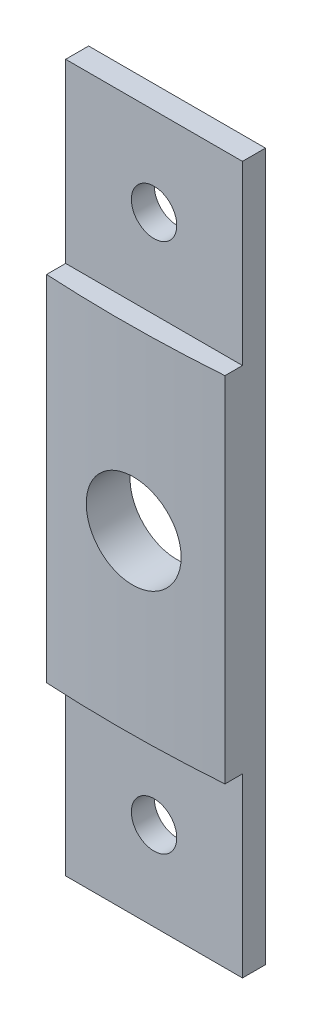
ISO-10303-21;
HEADER;
FILE_DESCRIPTION(('STEP AP214'),'2;1');
FILE_NAME('part.step','',(''),(''),'','','');
FILE_SCHEMA(('AUTOMOTIVE_DESIGN { 1 0 10303 214 1 1 1 1 }'));
ENDSEC;
DATA;
#1=APPLICATION_CONTEXT('core data for automotive mechanical design processes');
#2=APPLICATION_PROTOCOL_DEFINITION('international standard','automotive_design',2000,#1);
#3=PRODUCT_CONTEXT('',#1,'mechanical');
#4=PRODUCT('Part','Part','',(#3));
#5=PRODUCT_RELATED_PRODUCT_CATEGORY('part','',(#4));
#6=PRODUCT_DEFINITION_FORMATION('','',#4);
#7=PRODUCT_DEFINITION_CONTEXT('part definition',#1,'design');
#8=PRODUCT_DEFINITION('design','',#6,#7);
#9=PRODUCT_DEFINITION_SHAPE('','',#8);
#10=(LENGTH_UNIT() NAMED_UNIT(*) SI_UNIT(.MILLI.,.METRE.));
#11=(NAMED_UNIT(*) PLANE_ANGLE_UNIT() SI_UNIT($,.RADIAN.));
#12=(NAMED_UNIT(*) SI_UNIT($,.STERADIAN.) SOLID_ANGLE_UNIT());
#13=UNCERTAINTY_MEASURE_WITH_UNIT(LENGTH_MEASURE(1.E-05),#10,'distance_accuracy_value','');
#14=(GEOMETRIC_REPRESENTATION_CONTEXT(3) GLOBAL_UNCERTAINTY_ASSIGNED_CONTEXT((#13)) GLOBAL_UNIT_ASSIGNED_CONTEXT((#10,
#11,#12)) REPRESENTATION_CONTEXT('',''));
#15=CARTESIAN_POINT('',(0.,0.,0.));
#16=DIRECTION('',(0.,0.,1.));
#17=DIRECTION('',(1.,0.,0.));
#18=AXIS2_PLACEMENT_3D('',#15,#16,#17);
#19=CARTESIAN_POINT('',(0.,-278.797022402708,-95.25));
#20=DIRECTION('',(0.,1.,0.));
#21=DIRECTION('',(0.,0.,1.));
#22=AXIS2_PLACEMENT_3D('',#19,#20,#21);
#23=CYLINDRICAL_SURFACE('',#22,98.425);
#24=CARTESIAN_POINT('',(0.,2.37479674796748,-95.25));
#25=DIRECTION('',(0.,1.,0.));
#26=DIRECTION('',(0.,0.,1.));
#27=AXIS2_PLACEMENT_3D('',#24,#25,#26);
#28=CIRCLE('',#27,98.425);
#29=CARTESIAN_POINT('',(7.22764227642276,2.37479674796748,2.90926758143659));
#30=VERTEX_POINT('',#29);
#31=CARTESIAN_POINT('',(-5.47235772357724,2.37479674796748,3.02275271378738));
#32=VERTEX_POINT('',#31);
#33=EDGE_CURVE('E112',#30,#32,#28,.F.);
#34=ORIENTED_EDGE('',*,*,#33,.F.);
#35=DIRECTION('',(0.,1.,0.));
#36=VECTOR('',#35,1.);
#37=CARTESIAN_POINT('',(7.22764227642279,-278.797022402708,2.90926758143659));
#38=LINE('',#37,#36);
#39=CARTESIAN_POINT('',(7.22764227642276,27.7747967479675,2.9092675814366));
#40=VERTEX_POINT('',#39);
#41=EDGE_CURVE('E117',#40,#30,#38,.F.);
#42=ORIENTED_EDGE('',*,*,#41,.F.);
#43=CARTESIAN_POINT('',(0.,27.7747967479675,-95.25));
#44=DIRECTION('',(0.,-1.,0.));
#45=DIRECTION('',(0.,0.,-1.));
#46=AXIS2_PLACEMENT_3D('',#43,#44,#45);
#47=CIRCLE('',#46,98.425);
#48=CARTESIAN_POINT('',(-5.47235772357724,27.7747967479675,3.02275271378739));
#49=VERTEX_POINT('',#48);
#50=EDGE_CURVE('E47',#40,#49,#47,.T.);
#51=ORIENTED_EDGE('',*,*,#50,.T.);
#52=DIRECTION('',(0.,1.,0.));
#53=VECTOR('',#52,1.);
#54=CARTESIAN_POINT('',(-5.4723577235772,-278.797022402708,3.02275271378739));
#55=LINE('',#54,#53);
#56=EDGE_CURVE('E108',#49,#32,#55,.F.);
#57=ORIENTED_EDGE('',*,*,#56,.T.);
#58=EDGE_LOOP('',(#34,#42,#51,#57));
#59=FACE_BOUND('',#58,.T.);
#60=CARTESIAN_POINT('',(0.,18.337001412705,3.17500000000001));
#61=CARTESIAN_POINT('',(0.183163774329728,18.3862699131995,3.17499923295771));
#62=CARTESIAN_POINT('',(0.370618506350538,18.420112357294,3.1744833048946));
#63=CARTESIAN_POINT('',(0.748696883253728,18.4558831728512,3.17233438141036));
#64=CARTESIAN_POINT('',(0.939324030989922,18.4577735503428,3.17070005851524));
#65=CARTESIAN_POINT('',(1.31810349634827,18.4295342032097,3.16635570330243));
#66=CARTESIAN_POINT('',(1.50625697091006,18.3994200286868,3.16364619378798));
#67=CARTESIAN_POINT('',(1.87477767555351,18.3080601384446,3.15731586236169));
#68=CARTESIAN_POINT('',(2.05514678005276,18.246821963039,3.15369526128434));
#69=CARTESIAN_POINT('',(2.40311827028649,18.0949308812085,3.14581279900255));
#70=CARTESIAN_POINT('',(2.57071528735451,18.0042656886182,3.14155067035122));
#71=CARTESIAN_POINT('',(2.8883186641795,17.7960960163174,3.13273994796942));
#72=CARTESIAN_POINT('',(3.03832427364177,17.6785903924598,3.12819134203307));
#73=CARTESIAN_POINT('',(3.31657209541615,17.4199941230677,3.11920455482662));
#74=CARTESIAN_POINT('',(3.4448015474168,17.2788897446755,3.11476643959231));
#75=CARTESIAN_POINT('',(3.6757511501773,16.9771424388507,3.10640738089549));
#76=CARTESIAN_POINT('',(3.77847135945796,16.8164995562426,3.10248643624655));
#77=CARTESIAN_POINT('',(3.95547236390289,16.4802474922343,3.09552731700965));
#78=CARTESIAN_POINT('',(4.02975622278909,16.3046399256174,3.09248904733113));
#79=CARTESIAN_POINT('',(4.14778175991391,15.9434296465907,3.08758206459831));
#80=CARTESIAN_POINT('',(4.19152365595121,15.7578270054671,3.08571334320381));
#81=CARTESIAN_POINT('',(4.24719352568425,15.3820539635518,3.0833247698372));
#82=CARTESIAN_POINT('',(4.2591469367588,15.1918873379351,3.08280383936196));
#83=CARTESIAN_POINT('',(4.25097162182068,14.8122464901152,3.08315758298348));
#84=CARTESIAN_POINT('',(4.23084296557456,14.6227722664072,3.08403225404533));
#85=CARTESIAN_POINT('',(4.15909521199345,14.2499844164746,3.08709281873213));
#86=CARTESIAN_POINT('',(4.10749047589063,14.066668020909,3.08927811436575));
#87=CARTESIAN_POINT('',(3.97427343139461,13.711301571906,3.09475172078679));
#88=CARTESIAN_POINT('',(3.89266104142145,13.5392515490991,3.09804003457291));
#89=CARTESIAN_POINT('',(3.7016994688612,13.2112048603761,3.10541237133611));
#90=CARTESIAN_POINT('',(3.59233628440084,13.0552163544397,3.10949679575489));
#91=CARTESIAN_POINT('',(3.34899567947401,12.7638052149987,3.11808238570689));
#92=CARTESIAN_POINT('',(3.21501813116291,12.6283826883185,3.12258355340458));
#93=CARTESIAN_POINT('',(2.92612863370945,12.3818379238092,3.13160017938744));
#94=CARTESIAN_POINT('',(2.77120036625512,12.2707348065599,3.1361156461056));
#95=CARTESIAN_POINT('',(2.44488040810793,12.0761153318647,3.14476503433411));
#96=CARTESIAN_POINT('',(2.27348871175923,11.9925989838959,3.1488989557134));
#97=CARTESIAN_POINT('',(1.9190910085905,11.8555237927114,3.15644846982117));
#98=CARTESIAN_POINT('',(1.7360843655135,11.8019665922123,3.15986402315378));
#99=CARTESIAN_POINT('',(1.3636610963515,11.7263456210613,3.16572902326381));
#100=CARTESIAN_POINT('',(1.17424449522206,11.7042817278127,3.16817847380204));
#101=CARTESIAN_POINT('',(0.794502737236001,11.6922846944263,3.17197630756217));
#102=CARTESIAN_POINT('',(0.604178213629432,11.7023317222101,3.17332536975065));
#103=CARTESIAN_POINT('',(0.227911860858423,11.7542315993472,3.174915989193));
#104=CARTESIAN_POINT('',(0.041970021364355,11.7960843737292,3.17515754905743));
#105=CARTESIAN_POINT('',(-0.320181206052002,11.9103859625722,3.17464585069786));
#106=CARTESIAN_POINT('',(-0.496394170491173,11.9828234476875,3.17389296062354));
#107=CARTESIAN_POINT('',(-0.834163478701133,12.1562360566521,3.17161020455872));
#108=CARTESIAN_POINT('',(-0.995719788227125,12.2572112471767,3.17008033675289));
#109=CARTESIAN_POINT('',(-1.29963908752983,12.4848662961968,3.16653675381038));
#110=CARTESIAN_POINT('',(-1.44199664706101,12.6115534018714,3.16452290222816));
#111=CARTESIAN_POINT('',(-1.70342950580691,12.8870213305123,3.1603454308796));
#112=CARTESIAN_POINT('',(-1.82250477877466,13.0358021783854,3.15818181094442));
#113=CARTESIAN_POINT('',(-2.03403509884422,13.3512964635848,3.15403732242825));
#114=CARTESIAN_POINT('',(-2.12648063827912,13.5180162765876,3.15205651928981));
#115=CARTESIAN_POINT('',(-2.28206969548512,13.8646149047119,3.14857148784348));
#116=CARTESIAN_POINT('',(-2.34521318969307,14.044493730415,3.14706725991883));
#117=CARTESIAN_POINT('',(-2.4403977283043,14.4122833549272,3.14475276351811));
#118=CARTESIAN_POINT('',(-2.47244225527235,14.6001932519293,3.14394241734007));
#119=CARTESIAN_POINT('',(-2.50452941165419,14.9787277010001,3.14313097183225));
#120=CARTESIAN_POINT('',(-2.50457203705453,15.1693522534092,3.14312987260395));
#121=CARTESIAN_POINT('',(-2.47265841019071,15.5478526727738,3.14393697143129));
#122=CARTESIAN_POINT('',(-2.44071031229707,15.7357292278062,3.14474496325126));
#123=CARTESIAN_POINT('',(-2.34573740015336,16.1034440766247,3.14705470933214));
#124=CARTESIAN_POINT('',(-2.28271376063673,16.2832826739854,3.14855643736795));
#125=CARTESIAN_POINT('',(-2.12738281212904,16.6298260717582,3.15203692611609));
#126=CARTESIAN_POINT('',(-2.03507574237078,16.7965309794529,3.15401568293126));
#127=CARTESIAN_POINT('',(-1.82376422734408,17.1121244745433,3.15815836651779));
#128=CARTESIAN_POINT('',(-1.70475316928609,17.2610086349057,3.16032233907243));
#129=CARTESIAN_POINT('',(-1.44334539317461,17.5367861292119,3.16450326839776));
#130=CARTESIAN_POINT('',(-1.30093105885671,17.6636627484751,3.16652011275713));
#131=CARTESIAN_POINT('',(-0.9969207175112,17.8915784422674,3.17006789259945));
#132=CARTESIAN_POINT('',(-0.835347778578186,17.9926481364311,3.17159940444944));
#133=CARTESIAN_POINT('',(-0.560410582586963,18.1339668027216,3.17346205936598));
#134=CARTESIAN_POINT('',(-0.451402499054938,18.1828684278914,3.17402774268829));
#135=CARTESIAN_POINT('',(-0.22882937043118,18.2688834853283,3.17479695436329));
#136=CARTESIAN_POINT('',(-0.115264325101369,18.3059969169796,3.17500048269706));
#137=CARTESIAN_POINT('',(0.,18.337001412705,3.17500000000001));
#138=B_SPLINE_CURVE_WITH_KNOTS('',3,(#60,#61,#62,#63,#64,#65,#66,#67,#68,#69,#70,#71,#72,#73,
#74,#75,#76,#77,#78,#79,#80,#81,#82,#83,#84,#85,#86,#87,#88,#89,#90,#91,#92,#93,#94,#95,#96,#97,
#98,#99,#100,#101,#102,#103,#104,#105,#106,#107,#108,#109,#110,#111,#112,#113,#114,#115,#116,
#117,#118,#119,#120,#121,#122,#123,#124,#125,#126,#127,#128,#129,#130,#131,#132,#133,#134,#135,
#136,#137),.UNSPECIFIED.,.T.,.F.,(4,2,2,2,2,2,2,2,2,2,2,2,2,2,2,2,2,2,2,2,2,2,2,2,2,2,2,2,2,2,2,
2,2,2,2,2,2,2,4),(0.,0.56858743862936,1.13785093296673,1.70683796475568,2.27568721550947,
2.84477427445617,3.41388559683012,3.98332926276382,4.55277162232337,5.12215261309395,
5.69152954349385,6.26045071700899,6.82937065333402,7.39803120901285,7.96669331068534,
8.53564290763281,9.10459545973286,9.67399374371524,10.2433922233086,10.8128219210355,
11.3822494020859,11.9513252660743,12.5203997886633,13.0892636964301,13.6581289332947,
14.2271547341611,14.7961811765071,15.365410528405,15.9346403380459,16.5038063961,
17.072972525535,17.6419936125993,18.210993190888,18.7799881208193,19.3491241084971,
19.9186904788546,20.4875778913981,20.845387967056,21.2031980614077),.UNSPECIFIED.);
#139=CARTESIAN_POINT('',(0.,18.337001412705,3.17500000000001));
#140=VERTEX_POINT('',#139);
#141=EDGE_CURVE('E12',#140,#140,#138,.T.);
#142=ORIENTED_EDGE('',*,*,#141,.T.);
#143=EDGE_LOOP('',(#142));
#144=FACE_BOUND('',#143,.T.);
#145=ADVANCED_FACE('F38',(#59,#144),#23,.T.);
#146=CARTESIAN_POINT('',(-5.47235772357724,40.4747967479675,3.175));
#147=DIRECTION('',(1.,0.,0.));
#148=DIRECTION('',(0.,1.,0.));
#149=AXIS2_PLACEMENT_3D('',#146,#147,#148);
#150=PLANE('',#149);
#151=ORIENTED_EDGE('',*,*,#56,.F.);
#152=DIRECTION('',(0.,0.,-1.));
#153=VECTOR('',#152,1.);
#154=CARTESIAN_POINT('',(-5.47235772357724,27.7747967479675,3.175));
#155=LINE('',#154,#153);
#156=CARTESIAN_POINT('',(-5.47235772357724,27.7747967479675,1.651));
#157=VERTEX_POINT('',#156);
#158=EDGE_CURVE('E226',#49,#157,#155,.T.);
#159=ORIENTED_EDGE('',*,*,#158,.T.);
#160=DIRECTION('',(0.,1.,0.));
#161=VECTOR('',#160,1.);
#162=CARTESIAN_POINT('',(-5.47235772357724,40.4747967479675,1.651));
#163=LINE('',#162,#161);
#164=CARTESIAN_POINT('',(-5.47235772357724,40.4747967479675,1.651));
#165=VERTEX_POINT('',#164);
#166=EDGE_CURVE('E223',#157,#165,#163,.T.);
#167=ORIENTED_EDGE('',*,*,#166,.T.);
#168=DIRECTION('',(0.,0.,-1.));
#169=VECTOR('',#168,1.);
#170=CARTESIAN_POINT('',(-5.47235772357724,40.4747967479675,3.175));
#171=LINE('',#170,#169);
#172=CARTESIAN_POINT('',(-5.47235772357724,40.4747967479675,0.));
#173=VERTEX_POINT('',#172);
#174=EDGE_CURVE('E55',#165,#173,#171,.T.);
#175=ORIENTED_EDGE('',*,*,#174,.T.);
#176=DIRECTION('',(0.,-1.,0.));
#177=VECTOR('',#176,1.);
#178=CARTESIAN_POINT('',(-5.47235772357724,40.4747967479675,0.));
#179=LINE('',#178,#177);
#180=CARTESIAN_POINT('',(-5.47235772357724,-10.3252032520325,0.));
#181=VERTEX_POINT('',#180);
#182=EDGE_CURVE('E140',#173,#181,#179,.T.);
#183=ORIENTED_EDGE('',*,*,#182,.T.);
#184=DIRECTION('',(0.,0.,-1.));
#185=VECTOR('',#184,1.);
#186=CARTESIAN_POINT('',(-5.47235772357724,-10.3252032520325,3.175));
#187=LINE('',#186,#185);
#188=CARTESIAN_POINT('',(-5.47235772357724,-10.3252032520325,1.651));
#189=VERTEX_POINT('',#188);
#190=EDGE_CURVE('E156',#189,#181,#187,.T.);
#191=ORIENTED_EDGE('',*,*,#190,.F.);
#192=DIRECTION('',(0.,1.,0.));
#193=VECTOR('',#192,1.);
#194=CARTESIAN_POINT('',(-5.47235772357724,-10.3252032520325,1.651));
#195=LINE('',#194,#193);
#196=CARTESIAN_POINT('',(-5.47235772357724,2.37479674796748,1.651));
#197=VERTEX_POINT('',#196);
#198=EDGE_CURVE('E130',#189,#197,#195,.T.);
#199=ORIENTED_EDGE('',*,*,#198,.T.);
#200=DIRECTION('',(0.,0.,1.));
#201=VECTOR('',#200,1.);
#202=CARTESIAN_POINT('',(-5.47235772357724,2.37479674796748,3.175));
#203=LINE('',#202,#201);
#204=EDGE_CURVE('E123',#197,#32,#203,.T.);
#205=ORIENTED_EDGE('',*,*,#204,.T.);
#206=EDGE_LOOP('',(#151,#159,#167,#175,#183,#191,#199,#205));
#207=FACE_BOUND('',#206,.T.);
#208=ADVANCED_FACE('F40',(#207),#150,.F.);
#209=CARTESIAN_POINT('',(7.22764227642276,40.4747967479675,3.175));
#210=DIRECTION('',(1.,0.,0.));
#211=DIRECTION('',(0.,1.,0.));
#212=AXIS2_PLACEMENT_3D('',#209,#210,#211);
#213=PLANE('',#212);
#214=DIRECTION('',(0.,0.,-1.));
#215=VECTOR('',#214,1.);
#216=CARTESIAN_POINT('',(7.22764227642276,27.7747967479675,3.175));
#217=LINE('',#216,#215);
#218=CARTESIAN_POINT('',(7.22764227642276,27.7747967479675,1.651));
#219=VERTEX_POINT('',#218);
#220=EDGE_CURVE('E138',#40,#219,#217,.T.);
#221=ORIENTED_EDGE('',*,*,#220,.F.);
#222=ORIENTED_EDGE('',*,*,#41,.T.);
#223=DIRECTION('',(0.,0.,1.));
#224=VECTOR('',#223,1.);
#225=CARTESIAN_POINT('',(7.22764227642276,2.37479674796748,3.175));
#226=LINE('',#225,#224);
#227=CARTESIAN_POINT('',(7.22764227642276,2.37479674796748,1.651));
#228=VERTEX_POINT('',#227);
#229=EDGE_CURVE('E126',#228,#30,#226,.T.);
#230=ORIENTED_EDGE('',*,*,#229,.F.);
#231=DIRECTION('',(0.,1.,0.));
#232=VECTOR('',#231,1.);
#233=CARTESIAN_POINT('',(7.22764227642276,-10.3252032520325,1.651));
#234=LINE('',#233,#232);
#235=CARTESIAN_POINT('',(7.22764227642276,-10.3252032520325,1.651));
#236=VERTEX_POINT('',#235);
#237=EDGE_CURVE('E116',#236,#228,#234,.T.);
#238=ORIENTED_EDGE('',*,*,#237,.F.);
#239=DIRECTION('',(0.,0.,-1.));
#240=VECTOR('',#239,1.);
#241=CARTESIAN_POINT('',(7.22764227642276,-10.3252032520325,3.175));
#242=LINE('',#241,#240);
#243=CARTESIAN_POINT('',(7.22764227642276,-10.3252032520325,0.));
#244=VERTEX_POINT('',#243);
#245=EDGE_CURVE('E154',#236,#244,#242,.T.);
#246=ORIENTED_EDGE('',*,*,#245,.T.);
#247=DIRECTION('',(0.,-1.,0.));
#248=VECTOR('',#247,1.);
#249=CARTESIAN_POINT('',(7.22764227642276,40.4747967479675,0.));
#250=LINE('',#249,#248);
#251=CARTESIAN_POINT('',(7.22764227642276,40.4747967479675,0.));
#252=VERTEX_POINT('',#251);
#253=EDGE_CURVE('E146',#252,#244,#250,.T.);
#254=ORIENTED_EDGE('',*,*,#253,.F.);
#255=DIRECTION('',(0.,0.,-1.));
#256=VECTOR('',#255,1.);
#257=CARTESIAN_POINT('',(7.22764227642276,40.4747967479675,3.175));
#258=LINE('',#257,#256);
#259=CARTESIAN_POINT('',(7.22764227642276,40.4747967479675,1.651));
#260=VERTEX_POINT('',#259);
#261=EDGE_CURVE('E63',#260,#252,#258,.T.);
#262=ORIENTED_EDGE('',*,*,#261,.F.);
#263=DIRECTION('',(0.,1.,0.));
#264=VECTOR('',#263,1.);
#265=CARTESIAN_POINT('',(7.22764227642276,40.4747967479675,1.651));
#266=LINE('',#265,#264);
#267=EDGE_CURVE('E228',#219,#260,#266,.T.);
#268=ORIENTED_EDGE('',*,*,#267,.F.);
#269=EDGE_LOOP('',(#221,#222,#230,#238,#246,#254,#262,#268));
#270=FACE_BOUND('',#269,.T.);
#271=ADVANCED_FACE('F187',(#270),#213,.T.);
#272=CARTESIAN_POINT('',(-5.47235772357724,2.37479674796748,3.175));
#273=DIRECTION('',(0.,1.,0.));
#274=DIRECTION('',(0.,0.,1.));
#275=AXIS2_PLACEMENT_3D('',#272,#273,#274);
#276=PLANE('',#275);
#277=ORIENTED_EDGE('',*,*,#229,.T.);
#278=ORIENTED_EDGE('',*,*,#33,.T.);
#279=ORIENTED_EDGE('',*,*,#204,.F.);
#280=DIRECTION('',(1.,0.,0.));
#281=VECTOR('',#280,1.);
#282=CARTESIAN_POINT('',(-5.47235772357724,2.37479674796748,1.651));
#283=LINE('',#282,#281);
#284=EDGE_CURVE('E133',#197,#228,#283,.T.);
#285=ORIENTED_EDGE('',*,*,#284,.T.);
#286=EDGE_LOOP('',(#277,#278,#279,#285));
#287=FACE_BOUND('',#286,.T.);
#288=ADVANCED_FACE('F122',(#287),#276,.F.);
#289=CARTESIAN_POINT('',(-5.47235772357724,27.7747967479675,3.175));
#290=DIRECTION('',(0.,-1.,0.));
#291=DIRECTION('',(0.,0.,-1.));
#292=AXIS2_PLACEMENT_3D('',#289,#290,#291);
#293=PLANE('',#292);
#294=ORIENTED_EDGE('',*,*,#50,.F.);
#295=ORIENTED_EDGE('',*,*,#220,.T.);
#296=DIRECTION('',(1.,0.,0.));
#297=VECTOR('',#296,1.);
#298=CARTESIAN_POINT('',(-5.47235772357724,27.7747967479675,1.651));
#299=LINE('',#298,#297);
#300=EDGE_CURVE('E220',#157,#219,#299,.T.);
#301=ORIENTED_EDGE('',*,*,#300,.F.);
#302=ORIENTED_EDGE('',*,*,#158,.F.);
#303=EDGE_LOOP('',(#294,#295,#301,#302));
#304=FACE_BOUND('',#303,.T.);
#305=ADVANCED_FACE('F196',(#304),#293,.F.);
#306=CARTESIAN_POINT('',(-5.47235772357724,-10.3252032520325,3.175));
#307=DIRECTION('',(0.,1.,0.));
#308=DIRECTION('',(0.,0.,1.));
#309=AXIS2_PLACEMENT_3D('',#306,#307,#308);
#310=PLANE('',#309);
#311=ORIENTED_EDGE('',*,*,#245,.F.);
#312=DIRECTION('',(1.,0.,0.));
#313=VECTOR('',#312,1.);
#314=CARTESIAN_POINT('',(-5.47235772357724,-10.3252032520325,1.651));
#315=LINE('',#314,#313);
#316=EDGE_CURVE('E131',#189,#236,#315,.T.);
#317=ORIENTED_EDGE('',*,*,#316,.F.);
#318=ORIENTED_EDGE('',*,*,#190,.T.);
#319=DIRECTION('',(1.,0.,0.));
#320=VECTOR('',#319,1.);
#321=CARTESIAN_POINT('',(-5.47235772357724,-10.3252032520325,0.));
#322=LINE('',#321,#320);
#323=EDGE_CURVE('E142',#181,#244,#322,.T.);
#324=ORIENTED_EDGE('',*,*,#323,.T.);
#325=EDGE_LOOP('',(#311,#317,#318,#324));
#326=FACE_BOUND('',#325,.T.);
#327=ADVANCED_FACE('F202',(#326),#310,.F.);
#328=CARTESIAN_POINT('',(-5.47235772357724,40.4747967479675,3.175));
#329=DIRECTION('',(0.,1.,0.));
#330=DIRECTION('',(0.,0.,1.));
#331=AXIS2_PLACEMENT_3D('',#328,#329,#330);
#332=PLANE('',#331);
#333=DIRECTION('',(1.,0.,0.));
#334=VECTOR('',#333,1.);
#335=CARTESIAN_POINT('',(-5.47235772357724,40.4747967479675,1.651));
#336=LINE('',#335,#334);
#337=EDGE_CURVE('E143',#165,#260,#336,.T.);
#338=ORIENTED_EDGE('',*,*,#337,.T.);
#339=ORIENTED_EDGE('',*,*,#261,.T.);
#340=DIRECTION('',(1.,0.,0.));
#341=VECTOR('',#340,1.);
#342=CARTESIAN_POINT('',(-5.47235772357724,40.4747967479675,0.));
#343=LINE('',#342,#341);
#344=EDGE_CURVE('E149',#173,#252,#343,.T.);
#345=ORIENTED_EDGE('',*,*,#344,.F.);
#346=ORIENTED_EDGE('',*,*,#174,.F.);
#347=EDGE_LOOP('',(#338,#339,#345,#346));
#348=FACE_BOUND('',#347,.T.);
#349=ADVANCED_FACE('F200',(#348),#332,.T.);
#350=CARTESIAN_POINT('',(0.,0.,0.));
#351=DIRECTION('',(0.,0.,1.));
#352=DIRECTION('',(1.,0.,0.));
#353=AXIS2_PLACEMENT_3D('',#350,#351,#352);
#354=PLANE('',#353);
#355=CARTESIAN_POINT('',(0.877642276422763,-3.97520325203252,0.));
#356=DIRECTION('',(0.,0.,1.));
#357=DIRECTION('',(1.,0.,0.));
#358=AXIS2_PLACEMENT_3D('',#355,#356,#357);
#359=CIRCLE('',#358,1.63195);
#360=CARTESIAN_POINT('',(-0.754307723577237,-3.97520325203252,0.));
#361=VERTEX_POINT('',#360);
#362=EDGE_CURVE('E127',#361,#361,#359,.F.);
#363=ORIENTED_EDGE('',*,*,#362,.F.);
#364=EDGE_LOOP('',(#363));
#365=FACE_BOUND('',#364,.T.);
#366=CARTESIAN_POINT('',(0.877642276422763,34.1247967479675,0.));
#367=DIRECTION('',(0.,0.,1.));
#368=DIRECTION('',(1.,0.,0.));
#369=AXIS2_PLACEMENT_3D('',#366,#367,#368);
#370=CIRCLE('',#369,1.63195);
#371=CARTESIAN_POINT('',(-0.754307723577237,34.1247967479675,0.));
#372=VERTEX_POINT('',#371);
#373=EDGE_CURVE('E234',#372,#372,#370,.F.);
#374=ORIENTED_EDGE('',*,*,#373,.F.);
#375=EDGE_LOOP('',(#374));
#376=FACE_BOUND('',#375,.T.);
#377=CARTESIAN_POINT('',(0.877642276422763,15.0747967479675,0.));
#378=DIRECTION('',(0.,0.,1.));
#379=DIRECTION('',(1.,0.,0.));
#380=AXIS2_PLACEMENT_3D('',#377,#378,#379);
#381=CIRCLE('',#380,3.3782);
#382=CARTESIAN_POINT('',(4.25584227642276,15.0747967479675,0.));
#383=VERTEX_POINT('',#382);
#384=EDGE_CURVE('E237',#383,#383,#381,.F.);
#385=ORIENTED_EDGE('',*,*,#384,.F.);
#386=EDGE_LOOP('',(#385));
#387=FACE_BOUND('',#386,.T.);
#388=ORIENTED_EDGE('',*,*,#182,.F.);
#389=ORIENTED_EDGE('',*,*,#344,.T.);
#390=ORIENTED_EDGE('',*,*,#253,.T.);
#391=ORIENTED_EDGE('',*,*,#323,.F.);
#392=EDGE_LOOP('',(#388,#389,#390,#391));
#393=FACE_BOUND('',#392,.T.);
#394=ADVANCED_FACE('F209',(#365,#376,#387,#393),#354,.F.);
#395=CARTESIAN_POINT('',(-5.47235772357724,-10.3252032520325,1.651));
#396=DIRECTION('',(0.,0.,-1.));
#397=DIRECTION('',(-1.,0.,0.));
#398=AXIS2_PLACEMENT_3D('',#395,#396,#397);
#399=PLANE('',#398);
#400=CARTESIAN_POINT('',(0.877642276422763,-3.97520325203252,1.651));
#401=DIRECTION('',(0.,0.,-1.));
#402=DIRECTION('',(-1.,0.,0.));
#403=AXIS2_PLACEMENT_3D('',#400,#401,#402);
#404=CIRCLE('',#403,1.63195);
#405=CARTESIAN_POINT('',(-0.754307723577237,-3.97520325203252,1.651));
#406=VERTEX_POINT('',#405);
#407=EDGE_CURVE('E42',#406,#406,#404,.F.);
#408=ORIENTED_EDGE('',*,*,#407,.F.);
#409=EDGE_LOOP('',(#408));
#410=FACE_BOUND('',#409,.T.);
#411=ORIENTED_EDGE('',*,*,#284,.F.);
#412=ORIENTED_EDGE('',*,*,#198,.F.);
#413=ORIENTED_EDGE('',*,*,#316,.T.);
#414=ORIENTED_EDGE('',*,*,#237,.T.);
#415=EDGE_LOOP('',(#411,#412,#413,#414));
#416=FACE_BOUND('',#415,.T.);
#417=ADVANCED_FACE('F247',(#410,#416),#399,.F.);
#418=CARTESIAN_POINT('',(-5.47235772357724,40.4747967479675,1.651));
#419=DIRECTION('',(0.,0.,-1.));
#420=DIRECTION('',(0.,1.,0.));
#421=AXIS2_PLACEMENT_3D('',#418,#419,#420);
#422=PLANE('',#421);
#423=CARTESIAN_POINT('',(0.877642276422763,34.1247967479675,1.651));
#424=DIRECTION('',(0.,0.,-1.));
#425=DIRECTION('',(0.,1.,0.));
#426=AXIS2_PLACEMENT_3D('',#423,#424,#425);
#427=CIRCLE('',#426,1.63195);
#428=CARTESIAN_POINT('',(-0.754307723577237,34.1247967479675,1.651));
#429=VERTEX_POINT('',#428);
#430=EDGE_CURVE('E163',#429,#429,#427,.F.);
#431=ORIENTED_EDGE('',*,*,#430,.F.);
#432=EDGE_LOOP('',(#431));
#433=FACE_BOUND('',#432,.T.);
#434=ORIENTED_EDGE('',*,*,#337,.F.);
#435=ORIENTED_EDGE('',*,*,#166,.F.);
#436=ORIENTED_EDGE('',*,*,#300,.T.);
#437=ORIENTED_EDGE('',*,*,#267,.T.);
#438=EDGE_LOOP('',(#434,#435,#436,#437));
#439=FACE_BOUND('',#438,.T.);
#440=ADVANCED_FACE('F171',(#433,#439),#422,.F.);
#441=CARTESIAN_POINT('',(0.877642276422763,15.0747967479675,3.17500000000001));
#442=DIRECTION('',(0.,0.,-1.));
#443=DIRECTION('',(-1.,0.,0.));
#444=AXIS2_PLACEMENT_3D('',#441,#442,#443);
#445=CYLINDRICAL_SURFACE('',#444,3.3782);
#446=ORIENTED_EDGE('',*,*,#141,.F.);
#447=EDGE_LOOP('',(#446));
#448=FACE_BOUND('',#447,.T.);
#449=ORIENTED_EDGE('',*,*,#384,.T.);
#450=EDGE_LOOP('',(#449));
#451=FACE_BOUND('',#450,.T.);
#452=ADVANCED_FACE('F166',(#448,#451),#445,.F.);
#453=CARTESIAN_POINT('',(0.877642276422763,34.1247967479675,3.17500000000001));
#454=DIRECTION('',(0.,0.,-1.));
#455=DIRECTION('',(-1.,0.,0.));
#456=AXIS2_PLACEMENT_3D('',#453,#454,#455);
#457=CYLINDRICAL_SURFACE('',#456,1.63195);
#458=CARTESIAN_POINT('',(-0.754307723577237,34.1247967479675,1.651));
#459=CARTESIAN_POINT('',(-0.754307723577237,34.1247967479675,1.63380208333333));
#460=CARTESIAN_POINT('',(-0.754307723577237,34.1247967479675,1.61660416666667));
#461=CARTESIAN_POINT('',(-0.754307723577237,34.1247967479675,1.58220833333333));
#462=CARTESIAN_POINT('',(-0.754307723577237,34.1247967479675,1.56501041666667));
#463=CARTESIAN_POINT('',(-0.754307723577237,34.1247967479675,1.53061458333333));
#464=CARTESIAN_POINT('',(-0.754307723577237,34.1247967479675,1.51341666666667));
#465=CARTESIAN_POINT('',(-0.754307723577237,34.1247967479675,1.47902083333333));
#466=CARTESIAN_POINT('',(-0.754307723577237,34.1247967479675,1.46182291666667));
#467=CARTESIAN_POINT('',(-0.754307723577237,34.1247967479675,1.42742708333333));
#468=CARTESIAN_POINT('',(-0.754307723577237,34.1247967479675,1.41022916666667));
#469=CARTESIAN_POINT('',(-0.754307723577237,34.1247967479675,1.37583333333333));
#470=CARTESIAN_POINT('',(-0.754307723577237,34.1247967479675,1.35863541666667));
#471=CARTESIAN_POINT('',(-0.754307723577237,34.1247967479675,1.32423958333333));
#472=CARTESIAN_POINT('',(-0.754307723577237,34.1247967479675,1.30704166666667));
#473=CARTESIAN_POINT('',(-0.754307723577237,34.1247967479675,1.27264583333333));
#474=CARTESIAN_POINT('',(-0.754307723577237,34.1247967479675,1.25544791666667));
#475=CARTESIAN_POINT('',(-0.754307723577237,34.1247967479675,1.22105208333333));
#476=CARTESIAN_POINT('',(-0.754307723577237,34.1247967479675,1.20385416666667));
#477=CARTESIAN_POINT('',(-0.754307723577237,34.1247967479675,1.16945833333333));
#478=CARTESIAN_POINT('',(-0.754307723577237,34.1247967479675,1.15226041666667));
#479=CARTESIAN_POINT('',(-0.754307723577237,34.1247967479675,1.11786458333333));
#480=CARTESIAN_POINT('',(-0.754307723577237,34.1247967479675,1.10066666666667));
#481=CARTESIAN_POINT('',(-0.754307723577237,34.1247967479675,1.06627083333333));
#482=CARTESIAN_POINT('',(-0.754307723577237,34.1247967479675,1.04907291666667));
#483=CARTESIAN_POINT('',(-0.754307723577237,34.1247967479675,1.01467708333333));
#484=CARTESIAN_POINT('',(-0.754307723577237,34.1247967479675,0.997479166666666));
#485=CARTESIAN_POINT('',(-0.754307723577237,34.1247967479675,0.963083333333333));
#486=CARTESIAN_POINT('',(-0.754307723577237,34.1247967479675,0.945885416666666));
#487=CARTESIAN_POINT('',(-0.754307723577237,34.1247967479675,0.911489583333333));
#488=CARTESIAN_POINT('',(-0.754307723577237,34.1247967479675,0.894291666666666));
#489=CARTESIAN_POINT('',(-0.754307723577237,34.1247967479675,0.859895833333333));
#490=CARTESIAN_POINT('',(-0.754307723577237,34.1247967479675,0.842697916666666));
#491=CARTESIAN_POINT('',(-0.754307723577237,34.1247967479675,0.808302083333333));
#492=CARTESIAN_POINT('',(-0.754307723577237,34.1247967479675,0.791104166666666));
#493=CARTESIAN_POINT('',(-0.754307723577237,34.1247967479675,0.756708333333333));
#494=CARTESIAN_POINT('',(-0.754307723577237,34.1247967479675,0.739510416666666));
#495=CARTESIAN_POINT('',(-0.754307723577237,34.1247967479675,0.705114583333333));
#496=CARTESIAN_POINT('',(-0.754307723577237,34.1247967479675,0.687916666666666));
#497=CARTESIAN_POINT('',(-0.754307723577237,34.1247967479675,0.653520833333333));
#498=CARTESIAN_POINT('',(-0.754307723577237,34.1247967479675,0.636322916666666));
#499=CARTESIAN_POINT('',(-0.754307723577237,34.1247967479675,0.601927083333333));
#500=CARTESIAN_POINT('',(-0.754307723577237,34.1247967479675,0.584729166666666));
#501=CARTESIAN_POINT('',(-0.754307723577237,34.1247967479675,0.550333333333333));
#502=CARTESIAN_POINT('',(-0.754307723577237,34.1247967479675,0.533135416666666));
#503=CARTESIAN_POINT('',(-0.754307723577237,34.1247967479675,0.498739583333333));
#504=CARTESIAN_POINT('',(-0.754307723577237,34.1247967479675,0.481541666666666));
#505=CARTESIAN_POINT('',(-0.754307723577237,34.1247967479675,0.447145833333333));
#506=CARTESIAN_POINT('',(-0.754307723577237,34.1247967479675,0.429947916666666));
#507=CARTESIAN_POINT('',(-0.754307723577237,34.1247967479675,0.395552083333333));
#508=CARTESIAN_POINT('',(-0.754307723577237,34.1247967479675,0.378354166666666));
#509=CARTESIAN_POINT('',(-0.754307723577237,34.1247967479675,0.343958333333333));
#510=CARTESIAN_POINT('',(-0.754307723577237,34.1247967479675,0.326760416666666));
#511=CARTESIAN_POINT('',(-0.754307723577237,34.1247967479675,0.292364583333333));
#512=CARTESIAN_POINT('',(-0.754307723577237,34.1247967479675,0.275166666666666));
#513=CARTESIAN_POINT('',(-0.754307723577237,34.1247967479675,0.240770833333333));
#514=CARTESIAN_POINT('',(-0.754307723577237,34.1247967479675,0.223572916666666));
#515=CARTESIAN_POINT('',(-0.754307723577237,34.1247967479675,0.189177083333333));
#516=CARTESIAN_POINT('',(-0.754307723577237,34.1247967479675,0.171979166666666));
#517=CARTESIAN_POINT('',(-0.754307723577237,34.1247967479675,0.137583333333333));
#518=CARTESIAN_POINT('',(-0.754307723577237,34.1247967479675,0.120385416666666));
#519=CARTESIAN_POINT('',(-0.754307723577237,34.1247967479675,0.0859895833333329));
#520=CARTESIAN_POINT('',(-0.754307723577237,34.1247967479675,0.0687916666666662));
#521=CARTESIAN_POINT('',(-0.754307723577237,34.1247967479675,0.0343958333333329));
#522=CARTESIAN_POINT('',(-0.754307723577237,34.1247967479675,0.0171979166666662));
#523=CARTESIAN_POINT('',(-0.754307723577237,34.1247967479675,0.));
#524=B_SPLINE_CURVE_WITH_KNOTS('',3,(#458,#459,#460,#461,#462,#463,#464,#465,#466,#467,#468,
#469,#470,#471,#472,#473,#474,#475,#476,#477,#478,#479,#480,#481,#482,#483,#484,#485,#486,#487,
#488,#489,#490,#491,#492,#493,#494,#495,#496,#497,#498,#499,#500,#501,#502,#503,#504,#505,#506,
#507,#508,#509,#510,#511,#512,#513,#514,#515,#516,#517,#518,#519,#520,#521,#522,#523),
.UNSPECIFIED.,.F.,.F.,(4,2,2,2,2,2,2,2,2,2,2,2,2,2,2,2,2,2,2,2,2,2,2,2,2,2,2,2,2,2,2,2,4),(0.,
0.05159375,0.1031875,0.15478125,0.206375,0.25796875,0.3095625,0.36115625,0.41275,0.46434375,
0.5159375,0.56753125,0.619125,0.67071875,0.7223125,0.77390625,0.8255,0.87709375,0.9286875,
0.98028125,1.031875,1.08346875,1.1350625,1.18665625,1.23825,1.28984375,1.3414375,1.39303125,
1.444625,1.49621875,1.5478125,1.59940625,1.651),.UNSPECIFIED.);
#525=EDGE_CURVE('BSEAM170',#429,#372,#524,.T.);
#526=ORIENTED_EDGE('',*,*,#430,.T.);
#527=ORIENTED_EDGE('',*,*,#373,.T.);
#528=ORIENTED_EDGE('',*,*,#525,.T.);
#529=ORIENTED_EDGE('',*,*,#525,.F.);
#530=EDGE_LOOP('',(#526,#528,#527,#529));
#531=FACE_BOUND('',#530,.T.);
#532=ADVANCED_FACE('F170',(#531),#457,.F.);
#533=CARTESIAN_POINT('',(0.877642276422763,-3.97520325203252,3.17500000000001));
#534=DIRECTION('',(0.,0.,-1.));
#535=DIRECTION('',(-1.,0.,0.));
#536=AXIS2_PLACEMENT_3D('',#533,#534,#535);
#537=CYLINDRICAL_SURFACE('',#536,1.63195);
#538=CARTESIAN_POINT('',(-0.754307723577237,-3.97520325203252,1.651));
#539=CARTESIAN_POINT('',(-0.754307723577237,-3.97520325203252,1.63380208333333));
#540=CARTESIAN_POINT('',(-0.754307723577237,-3.97520325203252,1.61660416666667));
#541=CARTESIAN_POINT('',(-0.754307723577237,-3.97520325203252,1.58220833333333));
#542=CARTESIAN_POINT('',(-0.754307723577237,-3.97520325203252,1.56501041666667));
#543=CARTESIAN_POINT('',(-0.754307723577237,-3.97520325203252,1.53061458333333));
#544=CARTESIAN_POINT('',(-0.754307723577237,-3.97520325203252,1.51341666666667));
#545=CARTESIAN_POINT('',(-0.754307723577237,-3.97520325203252,1.47902083333333));
#546=CARTESIAN_POINT('',(-0.754307723577237,-3.97520325203252,1.46182291666667));
#547=CARTESIAN_POINT('',(-0.754307723577237,-3.97520325203252,1.42742708333333));
#548=CARTESIAN_POINT('',(-0.754307723577237,-3.97520325203252,1.41022916666667));
#549=CARTESIAN_POINT('',(-0.754307723577237,-3.97520325203252,1.37583333333333));
#550=CARTESIAN_POINT('',(-0.754307723577237,-3.97520325203252,1.35863541666667));
#551=CARTESIAN_POINT('',(-0.754307723577237,-3.97520325203252,1.32423958333333));
#552=CARTESIAN_POINT('',(-0.754307723577237,-3.97520325203252,1.30704166666667));
#553=CARTESIAN_POINT('',(-0.754307723577237,-3.97520325203252,1.27264583333333));
#554=CARTESIAN_POINT('',(-0.754307723577237,-3.97520325203252,1.25544791666667));
#555=CARTESIAN_POINT('',(-0.754307723577237,-3.97520325203252,1.22105208333333));
#556=CARTESIAN_POINT('',(-0.754307723577237,-3.97520325203252,1.20385416666667));
#557=CARTESIAN_POINT('',(-0.754307723577237,-3.97520325203252,1.16945833333333));
#558=CARTESIAN_POINT('',(-0.754307723577237,-3.97520325203252,1.15226041666667));
#559=CARTESIAN_POINT('',(-0.754307723577237,-3.97520325203252,1.11786458333333));
#560=CARTESIAN_POINT('',(-0.754307723577237,-3.97520325203252,1.10066666666667));
#561=CARTESIAN_POINT('',(-0.754307723577237,-3.97520325203252,1.06627083333333));
#562=CARTESIAN_POINT('',(-0.754307723577237,-3.97520325203252,1.04907291666667));
#563=CARTESIAN_POINT('',(-0.754307723577237,-3.97520325203252,1.01467708333333));
#564=CARTESIAN_POINT('',(-0.754307723577237,-3.97520325203252,0.997479166666666));
#565=CARTESIAN_POINT('',(-0.754307723577237,-3.97520325203252,0.963083333333333));
#566=CARTESIAN_POINT('',(-0.754307723577237,-3.97520325203252,0.945885416666666));
#567=CARTESIAN_POINT('',(-0.754307723577237,-3.97520325203252,0.911489583333333));
#568=CARTESIAN_POINT('',(-0.754307723577237,-3.97520325203252,0.894291666666666));
#569=CARTESIAN_POINT('',(-0.754307723577237,-3.97520325203252,0.859895833333333));
#570=CARTESIAN_POINT('',(-0.754307723577237,-3.97520325203252,0.842697916666666));
#571=CARTESIAN_POINT('',(-0.754307723577237,-3.97520325203252,0.808302083333333));
#572=CARTESIAN_POINT('',(-0.754307723577237,-3.97520325203252,0.791104166666666));
#573=CARTESIAN_POINT('',(-0.754307723577237,-3.97520325203252,0.756708333333333));
#574=CARTESIAN_POINT('',(-0.754307723577237,-3.97520325203252,0.739510416666667));
#575=CARTESIAN_POINT('',(-0.754307723577237,-3.97520325203252,0.705114583333333));
#576=CARTESIAN_POINT('',(-0.754307723577237,-3.97520325203252,0.687916666666667));
#577=CARTESIAN_POINT('',(-0.754307723577237,-3.97520325203252,0.653520833333333));
#578=CARTESIAN_POINT('',(-0.754307723577237,-3.97520325203252,0.636322916666667));
#579=CARTESIAN_POINT('',(-0.754307723577237,-3.97520325203252,0.601927083333333));
#580=CARTESIAN_POINT('',(-0.754307723577237,-3.97520325203252,0.584729166666667));
#581=CARTESIAN_POINT('',(-0.754307723577237,-3.97520325203252,0.550333333333333));
#582=CARTESIAN_POINT('',(-0.754307723577237,-3.97520325203252,0.533135416666666));
#583=CARTESIAN_POINT('',(-0.754307723577237,-3.97520325203252,0.498739583333333));
#584=CARTESIAN_POINT('',(-0.754307723577237,-3.97520325203252,0.481541666666666));
#585=CARTESIAN_POINT('',(-0.754307723577237,-3.97520325203252,0.447145833333333));
#586=CARTESIAN_POINT('',(-0.754307723577237,-3.97520325203252,0.429947916666666));
#587=CARTESIAN_POINT('',(-0.754307723577237,-3.97520325203252,0.395552083333333));
#588=CARTESIAN_POINT('',(-0.754307723577237,-3.97520325203252,0.378354166666666));
#589=CARTESIAN_POINT('',(-0.754307723577237,-3.97520325203252,0.343958333333333));
#590=CARTESIAN_POINT('',(-0.754307723577237,-3.97520325203252,0.326760416666666));
#591=CARTESIAN_POINT('',(-0.754307723577237,-3.97520325203252,0.292364583333333));
#592=CARTESIAN_POINT('',(-0.754307723577237,-3.97520325203252,0.275166666666666));
#593=CARTESIAN_POINT('',(-0.754307723577237,-3.97520325203252,0.240770833333333));
#594=CARTESIAN_POINT('',(-0.754307723577237,-3.97520325203252,0.223572916666666));
#595=CARTESIAN_POINT('',(-0.754307723577237,-3.97520325203252,0.189177083333333));
#596=CARTESIAN_POINT('',(-0.754307723577237,-3.97520325203252,0.171979166666666));
#597=CARTESIAN_POINT('',(-0.754307723577237,-3.97520325203252,0.137583333333333));
#598=CARTESIAN_POINT('',(-0.754307723577237,-3.97520325203252,0.120385416666666));
#599=CARTESIAN_POINT('',(-0.754307723577237,-3.97520325203252,0.0859895833333329));
#600=CARTESIAN_POINT('',(-0.754307723577237,-3.97520325203252,0.0687916666666662));
#601=CARTESIAN_POINT('',(-0.754307723577237,-3.97520325203252,0.0343958333333329));
#602=CARTESIAN_POINT('',(-0.754307723577237,-3.97520325203252,0.0171979166666662));
#603=CARTESIAN_POINT('',(-0.754307723577237,-3.97520325203252,0.));
#604=B_SPLINE_CURVE_WITH_KNOTS('',3,(#538,#539,#540,#541,#542,#543,#544,#545,#546,#547,#548,
#549,#550,#551,#552,#553,#554,#555,#556,#557,#558,#559,#560,#561,#562,#563,#564,#565,#566,#567,
#568,#569,#570,#571,#572,#573,#574,#575,#576,#577,#578,#579,#580,#581,#582,#583,#584,#585,#586,
#587,#588,#589,#590,#591,#592,#593,#594,#595,#596,#597,#598,#599,#600,#601,#602,#603),
.UNSPECIFIED.,.F.,.F.,(4,2,2,2,2,2,2,2,2,2,2,2,2,2,2,2,2,2,2,2,2,2,2,2,2,2,2,2,2,2,2,2,4),(0.,
0.05159375,0.1031875,0.15478125,0.206375,0.25796875,0.3095625,0.36115625,0.41275,0.46434375,
0.5159375,0.56753125,0.619125,0.67071875,0.7223125,0.77390625,0.8255,0.87709375,0.9286875,
0.98028125,1.031875,1.08346875,1.1350625,1.18665625,1.23825,1.28984375,1.3414375,1.39303125,
1.444625,1.49621875,1.5478125,1.59940625,1.651),.UNSPECIFIED.);
#605=EDGE_CURVE('BSEAM175',#406,#361,#604,.T.);
#606=ORIENTED_EDGE('',*,*,#407,.T.);
#607=ORIENTED_EDGE('',*,*,#362,.T.);
#608=ORIENTED_EDGE('',*,*,#605,.T.);
#609=ORIENTED_EDGE('',*,*,#605,.F.);
#610=EDGE_LOOP('',(#606,#608,#607,#609));
#611=FACE_BOUND('',#610,.T.);
#612=ADVANCED_FACE('F175',(#611),#537,.F.);
#613=CLOSED_SHELL('',(#145,#208,#271,#288,#305,#327,#349,#394,#417,#440,#452,#532,#612));
#614=MANIFOLD_SOLID_BREP('B2',#613);
#615=ADVANCED_BREP_SHAPE_REPRESENTATION('',(#18,#614),#14);
#616=SHAPE_DEFINITION_REPRESENTATION(#9,#615);
ENDSEC;
END-ISO-10303-21;
